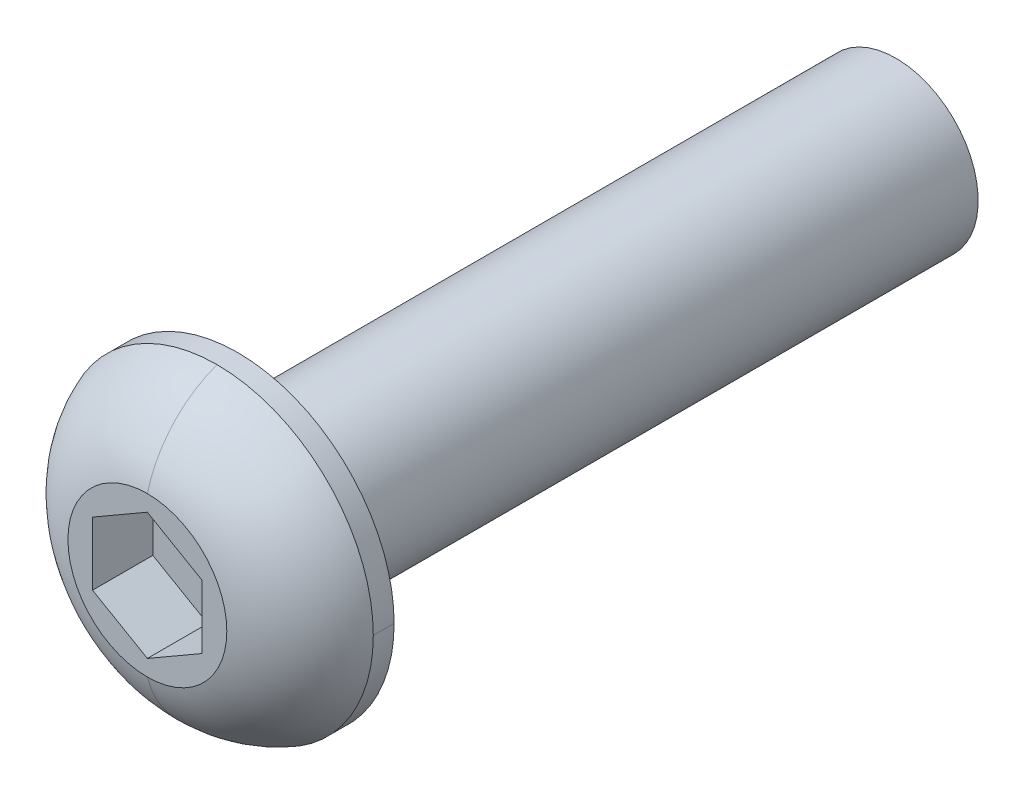
ISO-10303-21;
HEADER;
FILE_DESCRIPTION(('STEP AP214'),'2;1');
FILE_NAME('part.step','',(''),(''),'','','');
FILE_SCHEMA(('AUTOMOTIVE_DESIGN { 1 0 10303 214 1 1 1 1 }'));
ENDSEC;
DATA;
#1=APPLICATION_CONTEXT('core data for automotive mechanical design processes');
#2=APPLICATION_PROTOCOL_DEFINITION('international standard','automotive_design',2000,#1);
#3=PRODUCT_CONTEXT('',#1,'mechanical');
#4=PRODUCT('Part','Part','',(#3));
#5=PRODUCT_RELATED_PRODUCT_CATEGORY('part','',(#4));
#6=PRODUCT_DEFINITION_FORMATION('','',#4);
#7=PRODUCT_DEFINITION_CONTEXT('part definition',#1,'design');
#8=PRODUCT_DEFINITION('design','',#6,#7);
#9=PRODUCT_DEFINITION_SHAPE('','',#8);
#10=(LENGTH_UNIT() NAMED_UNIT(*) SI_UNIT(.MILLI.,.METRE.));
#11=(NAMED_UNIT(*) PLANE_ANGLE_UNIT() SI_UNIT($,.RADIAN.));
#12=(NAMED_UNIT(*) SI_UNIT($,.STERADIAN.) SOLID_ANGLE_UNIT());
#13=UNCERTAINTY_MEASURE_WITH_UNIT(LENGTH_MEASURE(1.E-05),#10,'distance_accuracy_value','');
#14=(GEOMETRIC_REPRESENTATION_CONTEXT(3) GLOBAL_UNCERTAINTY_ASSIGNED_CONTEXT((#13)) GLOBAL_UNIT_ASSIGNED_CONTEXT((#10,
#11,#12)) REPRESENTATION_CONTEXT('',''));
#15=CARTESIAN_POINT('',(0.,0.,0.));
#16=DIRECTION('',(0.,0.,1.));
#17=DIRECTION('',(1.,0.,0.));
#18=AXIS2_PLACEMENT_3D('',#15,#16,#17);
#19=CARTESIAN_POINT('',(0.,0.,0.190000000005322));
#20=DIRECTION('',(0.,0.,-1.));
#21=DIRECTION('',(-1.,0.,0.));
#22=AXIS2_PLACEMENT_3D('',#19,#20,#21);
#23=CYLINDRICAL_SURFACE('',#22,2.84999999998889);
#24=DIRECTION('',(0.,0.,-1.));
#25=VECTOR('',#24,1.);
#26=CARTESIAN_POINT('',(-2.84999999998889,0.,0.190000000005321));
#27=LINE('',#26,#25);
#28=CARTESIAN_POINT('',(-2.84999999997778,0.,0.380000000010643));
#29=VERTEX_POINT('',#28);
#30=CARTESIAN_POINT('',(-2.85,0.,0.));
#31=VERTEX_POINT('',#30);
#32=EDGE_CURVE('E198',#29,#31,#27,.T.);
#33=ORIENTED_EDGE('',*,*,#32,.F.);
#34=CARTESIAN_POINT('',(0.,0.,0.380000000010643));
#35=DIRECTION('',(0.,0.,-1.));
#36=DIRECTION('',(-1.,0.,0.));
#37=AXIS2_PLACEMENT_3D('',#34,#35,#36);
#38=CIRCLE('',#37,2.84999999997778);
#39=CARTESIAN_POINT('',(0.,2.84999999997778,0.380000000010643));
#40=VERTEX_POINT('',#39);
#41=EDGE_CURVE('E11',#29,#40,#38,.T.);
#42=ORIENTED_EDGE('',*,*,#41,.T.);
#43=CARTESIAN_POINT('',(0.,0.,0.380000000010643));
#44=DIRECTION('',(0.,0.,-1.));
#45=DIRECTION('',(-1.,0.,0.));
#46=AXIS2_PLACEMENT_3D('',#43,#44,#45);
#47=CIRCLE('',#46,2.84999999997778);
#48=CARTESIAN_POINT('',(2.84999999997778,0.,0.380000000010643));
#49=VERTEX_POINT('',#48);
#50=EDGE_CURVE('E41',#40,#49,#47,.T.);
#51=ORIENTED_EDGE('',*,*,#50,.T.);
#52=DIRECTION('',(0.,0.,1.));
#53=VECTOR('',#52,1.);
#54=CARTESIAN_POINT('',(2.84999999998889,0.,0.190000000005322));
#55=LINE('',#54,#53);
#56=CARTESIAN_POINT('',(2.85,0.,0.));
#57=VERTEX_POINT('',#56);
#58=EDGE_CURVE('E193',#57,#49,#55,.T.);
#59=ORIENTED_EDGE('',*,*,#58,.F.);
#60=CARTESIAN_POINT('',(0.,0.,0.));
#61=DIRECTION('',(0.,0.,-1.));
#62=DIRECTION('',(-1.,0.,0.));
#63=AXIS2_PLACEMENT_3D('',#60,#61,#62);
#64=CIRCLE('',#63,2.85);
#65=EDGE_CURVE('E189',#31,#57,#64,.T.);
#66=ORIENTED_EDGE('',*,*,#65,.F.);
#67=EDGE_LOOP('',(#33,#42,#51,#59,#66));
#68=FACE_BOUND('',#67,.T.);
#69=ADVANCED_FACE('F32',(#68),#23,.T.);
#70=CARTESIAN_POINT('',(0.,0.,-0.313131109201524));
#71=DIRECTION('',(0.,0.,-1.));
#72=DIRECTION('',(0.,-1.,0.));
#73=AXIS2_PLACEMENT_3D('',#70,#71,#72);
#74=DEGENERATE_TOROIDAL_SURFACE('',#73,0.945637928697733,2.02657978700265,.T.);
#75=CARTESIAN_POINT('',(0.,-0.945637928697733,-0.313131109201524));
#76=DIRECTION('',(1.,0.,0.));
#77=DIRECTION('',(0.,-1.,0.));
#78=AXIS2_PLACEMENT_3D('',#75,#76,#77);
#79=CIRCLE('',#78,2.02657978700265);
#80=CARTESIAN_POINT('',(0.,-1.44877,1.65));
#81=VERTEX_POINT('',#80);
#82=CARTESIAN_POINT('',(0.,-2.84999999997778,0.380000000010643));
#83=VERTEX_POINT('',#82);
#84=EDGE_CURVE('E167',#81,#83,#79,.T.);
#85=ORIENTED_EDGE('',*,*,#84,.F.);
#86=CARTESIAN_POINT('',(0.,0.,1.65));
#87=DIRECTION('',(0.,0.,-1.));
#88=DIRECTION('',(-1.,0.,0.));
#89=AXIS2_PLACEMENT_3D('',#86,#87,#88);
#90=CIRCLE('',#89,1.44877);
#91=CARTESIAN_POINT('',(-1.44877,0.,1.65));
#92=VERTEX_POINT('',#91);
#93=EDGE_CURVE('E182',#81,#92,#90,.T.);
#94=ORIENTED_EDGE('',*,*,#93,.T.);
#95=CARTESIAN_POINT('',(0.,0.,1.65));
#96=DIRECTION('',(0.,0.,-1.));
#97=DIRECTION('',(-1.,0.,0.));
#98=AXIS2_PLACEMENT_3D('',#95,#96,#97);
#99=CIRCLE('',#98,1.44877);
#100=CARTESIAN_POINT('',(0.,1.44877,1.65));
#101=VERTEX_POINT('',#100);
#102=EDGE_CURVE('E149',#92,#101,#99,.T.);
#103=ORIENTED_EDGE('',*,*,#102,.T.);
#104=CARTESIAN_POINT('',(0.,0.945637928697733,-0.313131109201524));
#105=DIRECTION('',(1.,0.,0.));
#106=DIRECTION('',(0.,1.,0.));
#107=AXIS2_PLACEMENT_3D('',#104,#105,#106);
#108=CIRCLE('',#107,2.02657978700265);
#109=EDGE_CURVE('E197',#40,#101,#108,.T.);
#110=ORIENTED_EDGE('',*,*,#109,.F.);
#111=ORIENTED_EDGE('',*,*,#41,.F.);
#112=CARTESIAN_POINT('',(0.,0.,0.380000000010643));
#113=DIRECTION('',(0.,0.,-1.));
#114=DIRECTION('',(-1.,0.,0.));
#115=AXIS2_PLACEMENT_3D('',#112,#113,#114);
#116=CIRCLE('',#115,2.84999999997778);
#117=EDGE_CURVE('E194',#83,#29,#116,.T.);
#118=ORIENTED_EDGE('',*,*,#117,.F.);
#119=EDGE_LOOP('',(#85,#94,#103,#110,#111,#118));
#120=FACE_BOUND('',#119,.T.);
#121=ADVANCED_FACE('F275',(#120),#74,.T.);
#122=CARTESIAN_POINT('',(0.,0.,-3.89665));
#123=DIRECTION('',(0.,0.,-1.));
#124=DIRECTION('',(-1.,0.,0.));
#125=AXIS2_PLACEMENT_3D('',#122,#123,#124);
#126=CYLINDRICAL_SURFACE('',#125,1.5);
#127=DIRECTION('',(0.,0.,1.));
#128=VECTOR('',#127,1.);
#129=CARTESIAN_POINT('',(1.5,0.,-3.89665));
#130=LINE('',#129,#128);
#131=CARTESIAN_POINT('',(1.5,0.,-7.));
#132=VERTEX_POINT('',#131);
#133=CARTESIAN_POINT('',(1.5,0.,-0.1));
#134=VERTEX_POINT('',#133);
#135=EDGE_CURVE('E48',#132,#134,#130,.T.);
#136=ORIENTED_EDGE('',*,*,#135,.F.);
#137=ORIENTED_EDGE('',*,*,#135,.T.);
#138=CARTESIAN_POINT('',(0.,0.,-0.1));
#139=DIRECTION('',(0.,0.,-1.));
#140=DIRECTION('',(-1.,0.,0.));
#141=AXIS2_PLACEMENT_3D('',#138,#139,#140);
#142=CIRCLE('',#141,1.5);
#143=CARTESIAN_POINT('',(0.,-1.5,-0.1));
#144=VERTEX_POINT('',#143);
#145=EDGE_CURVE('E152',#134,#144,#142,.T.);
#146=ORIENTED_EDGE('',*,*,#145,.T.);
#147=CARTESIAN_POINT('',(0.,0.,-0.1));
#148=DIRECTION('',(0.,0.,-1.));
#149=DIRECTION('',(-1.,0.,0.));
#150=AXIS2_PLACEMENT_3D('',#147,#148,#149);
#151=CIRCLE('',#150,1.5);
#152=CARTESIAN_POINT('',(-1.5,0.,-0.1));
#153=VERTEX_POINT('',#152);
#154=EDGE_CURVE('E146',#144,#153,#151,.T.);
#155=ORIENTED_EDGE('',*,*,#154,.T.);
#156=DIRECTION('',(0.,0.,-1.));
#157=VECTOR('',#156,1.);
#158=CARTESIAN_POINT('',(-1.5,0.,-3.89665));
#159=LINE('',#158,#157);
#160=CARTESIAN_POINT('',(-1.5,0.,-7.));
#161=VERTEX_POINT('',#160);
#162=EDGE_CURVE('E53',#153,#161,#159,.T.);
#163=ORIENTED_EDGE('',*,*,#162,.T.);
#164=ORIENTED_EDGE('',*,*,#162,.F.);
#165=CARTESIAN_POINT('',(0.,0.,-0.1));
#166=DIRECTION('',(0.,0.,-1.));
#167=DIRECTION('',(-1.,0.,0.));
#168=AXIS2_PLACEMENT_3D('',#165,#166,#167);
#169=CIRCLE('',#168,1.5);
#170=CARTESIAN_POINT('',(0.,1.5,-0.1));
#171=VERTEX_POINT('',#170);
#172=EDGE_CURVE('E139',#153,#171,#169,.T.);
#173=ORIENTED_EDGE('',*,*,#172,.T.);
#174=CARTESIAN_POINT('',(0.,0.,-0.1));
#175=DIRECTION('',(0.,0.,-1.));
#176=DIRECTION('',(-1.,0.,0.));
#177=AXIS2_PLACEMENT_3D('',#174,#175,#176);
#178=CIRCLE('',#177,1.5);
#179=EDGE_CURVE('E36',#171,#134,#178,.T.);
#180=ORIENTED_EDGE('',*,*,#179,.T.);
#181=EDGE_LOOP('',(#136,#137,#146,#155,#163,#164,#173,#180));
#182=FACE_BOUND('',#181,.T.);
#183=CARTESIAN_POINT('',(0.,0.,-12.));
#184=DIRECTION('',(0.,0.,-1.));
#185=DIRECTION('',(-1.,0.,0.));
#186=AXIS2_PLACEMENT_3D('',#183,#184,#185);
#187=CIRCLE('',#186,1.5);
#188=CARTESIAN_POINT('',(-1.5,0.,-12.));
#189=VERTEX_POINT('',#188);
#190=EDGE_CURVE('E228',#189,#189,#187,.T.);
#191=ORIENTED_EDGE('',*,*,#190,.F.);
#192=EDGE_LOOP('',(#191));
#193=FACE_BOUND('',#192,.T.);
#194=ADVANCED_FACE('F137',(#182,#193),#126,.T.);
#195=CARTESIAN_POINT('',(0.,0.,-0.1));
#196=DIRECTION('',(0.,0.,-1.));
#197=DIRECTION('',(0.,-1.,0.));
#198=AXIS2_PLACEMENT_3D('',#195,#196,#197);
#199=TOROIDAL_SURFACE('',#198,1.6,0.1);
#200=CARTESIAN_POINT('',(0.,1.6,-0.1));
#201=DIRECTION('',(1.,0.,0.));
#202=DIRECTION('',(0.,1.,0.));
#203=AXIS2_PLACEMENT_3D('',#200,#201,#202);
#204=CIRCLE('',#203,0.1);
#205=CARTESIAN_POINT('',(0.,1.6,0.));
#206=VERTEX_POINT('',#205);
#207=EDGE_CURVE('E148',#206,#171,#204,.T.);
#208=ORIENTED_EDGE('',*,*,#207,.F.);
#209=CARTESIAN_POINT('',(0.,0.,0.));
#210=DIRECTION('',(0.,0.,-1.));
#211=DIRECTION('',(-1.,0.,0.));
#212=AXIS2_PLACEMENT_3D('',#209,#210,#211);
#213=CIRCLE('',#212,1.6);
#214=CARTESIAN_POINT('',(0.,-1.6,0.));
#215=VERTEX_POINT('',#214);
#216=EDGE_CURVE('E233',#206,#215,#213,.T.);
#217=ORIENTED_EDGE('',*,*,#216,.T.);
#218=CARTESIAN_POINT('',(0.,-1.6,-0.1));
#219=DIRECTION('',(1.,0.,0.));
#220=DIRECTION('',(0.,-1.,0.));
#221=AXIS2_PLACEMENT_3D('',#218,#219,#220);
#222=CIRCLE('',#221,0.1);
#223=EDGE_CURVE('E222',#144,#215,#222,.T.);
#224=ORIENTED_EDGE('',*,*,#223,.F.);
#225=ORIENTED_EDGE('',*,*,#145,.F.);
#226=ORIENTED_EDGE('',*,*,#179,.F.);
#227=EDGE_LOOP('',(#208,#217,#224,#225,#226));
#228=FACE_BOUND('',#227,.T.);
#229=ADVANCED_FACE('F274',(#228),#199,.F.);
#230=CARTESIAN_POINT('',(1.,0.2886751346,1.65));
#231=DIRECTION('',(1.,0.,0.));
#232=DIRECTION('',(0.,1.,0.));
#233=AXIS2_PLACEMENT_3D('',#230,#231,#232);
#234=PLANE('',#233);
#235=DIRECTION('',(0.,1.,0.));
#236=VECTOR('',#235,1.);
#237=CARTESIAN_POINT('',(1.,0.,0.55));
#238=LINE('',#237,#236);
#239=CARTESIAN_POINT('',(1.,-0.5773502692,0.55));
#240=VERTEX_POINT('',#239);
#241=CARTESIAN_POINT('',(1.,0.5773502692,0.55));
#242=VERTEX_POINT('',#241);
#243=EDGE_CURVE('E170',#240,#242,#238,.T.);
#244=ORIENTED_EDGE('',*,*,#243,.F.);
#245=DIRECTION('',(0.,0.,-1.));
#246=VECTOR('',#245,1.);
#247=CARTESIAN_POINT('',(1.,-0.5773502692,1.65));
#248=LINE('',#247,#246);
#249=CARTESIAN_POINT('',(1.,-0.5773502692,1.65));
#250=VERTEX_POINT('',#249);
#251=EDGE_CURVE('E179',#250,#240,#248,.T.);
#252=ORIENTED_EDGE('',*,*,#251,.F.);
#253=DIRECTION('',(0.,-1.,0.));
#254=VECTOR('',#253,1.);
#255=CARTESIAN_POINT('',(1.,0.1443375673,1.65));
#256=LINE('',#255,#254);
#257=CARTESIAN_POINT('',(1.,0.5773502692,1.65));
#258=VERTEX_POINT('',#257);
#259=EDGE_CURVE('E154',#258,#250,#256,.T.);
#260=ORIENTED_EDGE('',*,*,#259,.F.);
#261=DIRECTION('',(0.,0.,-1.));
#262=VECTOR('',#261,1.);
#263=CARTESIAN_POINT('',(1.,0.5773502692,1.65));
#264=LINE('',#263,#262);
#265=EDGE_CURVE('E230',#258,#242,#264,.T.);
#266=ORIENTED_EDGE('',*,*,#265,.T.);
#267=EDGE_LOOP('',(#244,#252,#260,#266));
#268=FACE_BOUND('',#267,.T.);
#269=ADVANCED_FACE('F34',(#268),#234,.F.);
#270=CARTESIAN_POINT('',(0.5,0.8660254038,1.65));
#271=DIRECTION('',(0.500000000006738,0.866025403780548,0.));
#272=DIRECTION('',(0.,0.,-1.));
#273=AXIS2_PLACEMENT_3D('',#270,#271,#272);
#274=PLANE('',#273);
#275=DIRECTION('',(-0.866025403780548,0.500000000006738,0.));
#276=VECTOR('',#275,1.);
#277=CARTESIAN_POINT('',(0.,1.1547005384,0.55));
#278=LINE('',#277,#276);
#279=CARTESIAN_POINT('',(0.,1.1547005384,0.55));
#280=VERTEX_POINT('',#279);
#281=EDGE_CURVE('E168',#242,#280,#278,.T.);
#282=ORIENTED_EDGE('',*,*,#281,.F.);
#283=ORIENTED_EDGE('',*,*,#265,.F.);
#284=DIRECTION('',(0.866025403780548,-0.500000000006738,0.));
#285=VECTOR('',#284,1.);
#286=CARTESIAN_POINT('',(0.0127306250111162,1.14735050862275,1.65));
#287=LINE('',#286,#285);
#288=CARTESIAN_POINT('',(0.,1.1547005384,1.65));
#289=VERTEX_POINT('',#288);
#290=EDGE_CURVE('E163',#289,#258,#287,.T.);
#291=ORIENTED_EDGE('',*,*,#290,.F.);
#292=DIRECTION('',(0.,0.,-1.));
#293=VECTOR('',#292,1.);
#294=CARTESIAN_POINT('',(0.,1.1547005384,1.65));
#295=LINE('',#294,#293);
#296=EDGE_CURVE('E211',#289,#280,#295,.T.);
#297=ORIENTED_EDGE('',*,*,#296,.T.);
#298=EDGE_LOOP('',(#282,#283,#291,#297));
#299=FACE_BOUND('',#298,.T.);
#300=ADVANCED_FACE('F325',(#299),#274,.F.);
#301=CARTESIAN_POINT('',(-0.5,0.8660254038,1.65));
#302=DIRECTION('',(-0.500000000006738,0.866025403780548,0.));
#303=DIRECTION('',(0.,0.,1.));
#304=AXIS2_PLACEMENT_3D('',#301,#302,#303);
#305=PLANE('',#304);
#306=DIRECTION('',(-0.866025403780548,-0.500000000006738,0.));
#307=VECTOR('',#306,1.);
#308=CARTESIAN_POINT('',(-1.,0.5773502692,0.55));
#309=LINE('',#308,#307);
#310=CARTESIAN_POINT('',(-1.,0.5773502692,0.55));
#311=VERTEX_POINT('',#310);
#312=EDGE_CURVE('E171',#280,#311,#309,.T.);
#313=ORIENTED_EDGE('',*,*,#312,.F.);
#314=ORIENTED_EDGE('',*,*,#296,.F.);
#315=DIRECTION('',(0.866025403780548,0.500000000006738,0.));
#316=VECTOR('',#315,1.);
#317=CARTESIAN_POINT('',(-0.98726937500236,0.584700298969471,1.65));
#318=LINE('',#317,#316);
#319=CARTESIAN_POINT('',(-1.,0.5773502692,1.65));
#320=VERTEX_POINT('',#319);
#321=EDGE_CURVE('E166',#320,#289,#318,.T.);
#322=ORIENTED_EDGE('',*,*,#321,.F.);
#323=DIRECTION('',(0.,0.,-1.));
#324=VECTOR('',#323,1.);
#325=CARTESIAN_POINT('',(-1.,0.5773502692,1.65));
#326=LINE('',#325,#324);
#327=EDGE_CURVE('E213',#320,#311,#326,.T.);
#328=ORIENTED_EDGE('',*,*,#327,.T.);
#329=EDGE_LOOP('',(#313,#314,#322,#328));
#330=FACE_BOUND('',#329,.T.);
#331=ADVANCED_FACE('F322',(#330),#305,.F.);
#332=CARTESIAN_POINT('',(-1.,0.,1.65));
#333=DIRECTION('',(-1.,0.,0.));
#334=DIRECTION('',(0.,0.,1.));
#335=AXIS2_PLACEMENT_3D('',#332,#333,#334);
#336=PLANE('',#335);
#337=DIRECTION('',(0.,-1.,0.));
#338=VECTOR('',#337,1.);
#339=CARTESIAN_POINT('',(-1.,-0.5773502692,0.55));
#340=LINE('',#339,#338);
#341=CARTESIAN_POINT('',(-1.,-0.5773502692,0.55));
#342=VERTEX_POINT('',#341);
#343=EDGE_CURVE('E172',#311,#342,#340,.T.);
#344=ORIENTED_EDGE('',*,*,#343,.F.);
#345=ORIENTED_EDGE('',*,*,#327,.F.);
#346=DIRECTION('',(0.,1.,0.));
#347=VECTOR('',#346,1.);
#348=CARTESIAN_POINT('',(-1.,0.,1.65));
#349=LINE('',#348,#347);
#350=CARTESIAN_POINT('',(-1.,-0.5773502692,1.65));
#351=VERTEX_POINT('',#350);
#352=EDGE_CURVE('E183',#351,#320,#349,.T.);
#353=ORIENTED_EDGE('',*,*,#352,.F.);
#354=DIRECTION('',(0.,0.,-1.));
#355=VECTOR('',#354,1.);
#356=CARTESIAN_POINT('',(-1.,-0.5773502692,1.65));
#357=LINE('',#356,#355);
#358=EDGE_CURVE('E178',#351,#342,#357,.T.);
#359=ORIENTED_EDGE('',*,*,#358,.T.);
#360=EDGE_LOOP('',(#344,#345,#353,#359));
#361=FACE_BOUND('',#360,.T.);
#362=ADVANCED_FACE('F260',(#361),#336,.F.);
#363=CARTESIAN_POINT('',(-0.5,-0.8660254038,1.65));
#364=DIRECTION('',(-0.500000000006738,-0.866025403780548,0.));
#365=DIRECTION('',(-0.866025403780548,0.500000000006738,0.));
#366=AXIS2_PLACEMENT_3D('',#363,#364,#365);
#367=PLANE('',#366);
#368=DIRECTION('',(0.866025403780548,-0.500000000006738,0.));
#369=VECTOR('',#368,1.);
#370=CARTESIAN_POINT('',(0.,-1.1547005384,0.55));
#371=LINE('',#370,#369);
#372=CARTESIAN_POINT('',(0.,-1.1547005384,0.55));
#373=VERTEX_POINT('',#372);
#374=EDGE_CURVE('E174',#342,#373,#371,.T.);
#375=ORIENTED_EDGE('',*,*,#374,.F.);
#376=ORIENTED_EDGE('',*,*,#358,.F.);
#377=DIRECTION('',(-0.866025403780548,0.500000000006738,0.));
#378=VECTOR('',#377,1.);
#379=CARTESIAN_POINT('',(-0.98726937500236,-0.584700298969471,1.65));
#380=LINE('',#379,#378);
#381=CARTESIAN_POINT('',(0.,-1.1547005384,1.65));
#382=VERTEX_POINT('',#381);
#383=EDGE_CURVE('E161',#382,#351,#380,.T.);
#384=ORIENTED_EDGE('',*,*,#383,.F.);
#385=DIRECTION('',(0.,0.,-1.));
#386=VECTOR('',#385,1.);
#387=CARTESIAN_POINT('',(0.,-1.1547005384,1.65));
#388=LINE('',#387,#386);
#389=EDGE_CURVE('E175',#382,#373,#388,.T.);
#390=ORIENTED_EDGE('',*,*,#389,.T.);
#391=EDGE_LOOP('',(#375,#376,#384,#390));
#392=FACE_BOUND('',#391,.T.);
#393=ADVANCED_FACE('F247',(#392),#367,.F.);
#394=CARTESIAN_POINT('',(0.5,-0.8660254038,1.65));
#395=DIRECTION('',(0.500000000006738,-0.866025403780548,0.));
#396=DIRECTION('',(0.,0.,-1.));
#397=AXIS2_PLACEMENT_3D('',#394,#395,#396);
#398=PLANE('',#397);
#399=DIRECTION('',(0.866025403780548,0.500000000006738,0.));
#400=VECTOR('',#399,1.);
#401=CARTESIAN_POINT('',(1.,-0.5773502692,0.55));
#402=LINE('',#401,#400);
#403=EDGE_CURVE('E216',#373,#240,#402,.T.);
#404=ORIENTED_EDGE('',*,*,#403,.F.);
#405=ORIENTED_EDGE('',*,*,#389,.F.);
#406=DIRECTION('',(-0.866025403780548,-0.500000000006738,0.));
#407=VECTOR('',#406,1.);
#408=CARTESIAN_POINT('',(0.0127306250111161,-1.14735050862275,1.65));
#409=LINE('',#408,#407);
#410=EDGE_CURVE('E157',#250,#382,#409,.T.);
#411=ORIENTED_EDGE('',*,*,#410,.F.);
#412=ORIENTED_EDGE('',*,*,#251,.T.);
#413=EDGE_LOOP('',(#404,#405,#411,#412));
#414=FACE_BOUND('',#413,.T.);
#415=ADVANCED_FACE('F251',(#414),#398,.F.);
#416=CARTESIAN_POINT('',(0.,0.,0.55));
#417=DIRECTION('',(0.,0.,-1.));
#418=DIRECTION('',(0.,-1.,0.));
#419=AXIS2_PLACEMENT_3D('',#416,#417,#418);
#420=PLANE('',#419);
#421=ORIENTED_EDGE('',*,*,#243,.T.);
#422=ORIENTED_EDGE('',*,*,#281,.T.);
#423=ORIENTED_EDGE('',*,*,#312,.T.);
#424=ORIENTED_EDGE('',*,*,#343,.T.);
#425=ORIENTED_EDGE('',*,*,#374,.T.);
#426=ORIENTED_EDGE('',*,*,#403,.T.);
#427=EDGE_LOOP('',(#421,#422,#423,#424,#425,#426));
#428=FACE_BOUND('',#427,.T.);
#429=ADVANCED_FACE('F255',(#428),#420,.F.);
#430=CARTESIAN_POINT('',(-2.225,0.,0.));
#431=DIRECTION('',(0.,0.,-1.));
#432=DIRECTION('',(0.,-1.,0.));
#433=AXIS2_PLACEMENT_3D('',#430,#431,#432);
#434=PLANE('',#433);
#435=ORIENTED_EDGE('',*,*,#65,.T.);
#436=CARTESIAN_POINT('',(0.,0.,0.));
#437=DIRECTION('',(0.,0.,-1.));
#438=DIRECTION('',(-1.,0.,0.));
#439=AXIS2_PLACEMENT_3D('',#436,#437,#438);
#440=CIRCLE('',#439,2.85);
#441=EDGE_CURVE('E186',#57,#31,#440,.T.);
#442=ORIENTED_EDGE('',*,*,#441,.T.);
#443=EDGE_LOOP('',(#435,#442));
#444=FACE_BOUND('',#443,.T.);
#445=CARTESIAN_POINT('',(0.,0.,0.));
#446=DIRECTION('',(0.,0.,-1.));
#447=DIRECTION('',(-1.,0.,0.));
#448=AXIS2_PLACEMENT_3D('',#445,#446,#447);
#449=CIRCLE('',#448,1.6);
#450=CARTESIAN_POINT('',(-1.6,0.,0.));
#451=VERTEX_POINT('',#450);
#452=EDGE_CURVE('E141',#451,#206,#449,.T.);
#453=ORIENTED_EDGE('',*,*,#452,.F.);
#454=CARTESIAN_POINT('',(0.,0.,0.));
#455=DIRECTION('',(0.,0.,-1.));
#456=DIRECTION('',(-1.,0.,0.));
#457=AXIS2_PLACEMENT_3D('',#454,#455,#456);
#458=CIRCLE('',#457,1.6);
#459=EDGE_CURVE('E219',#215,#451,#458,.T.);
#460=ORIENTED_EDGE('',*,*,#459,.F.);
#461=ORIENTED_EDGE('',*,*,#216,.F.);
#462=EDGE_LOOP('',(#453,#460,#461));
#463=FACE_BOUND('',#462,.T.);
#464=ADVANCED_FACE('F299',(#444,#463),#434,.T.);
#465=CARTESIAN_POINT('',(0.,0.,-0.1));
#466=DIRECTION('',(0.,0.,-1.));
#467=DIRECTION('',(0.,-1.,0.));
#468=AXIS2_PLACEMENT_3D('',#465,#466,#467);
#469=TOROIDAL_SURFACE('',#468,1.6,0.1);
#470=ORIENTED_EDGE('',*,*,#207,.T.);
#471=ORIENTED_EDGE('',*,*,#172,.F.);
#472=ORIENTED_EDGE('',*,*,#154,.F.);
#473=ORIENTED_EDGE('',*,*,#223,.T.);
#474=ORIENTED_EDGE('',*,*,#459,.T.);
#475=ORIENTED_EDGE('',*,*,#452,.T.);
#476=EDGE_LOOP('',(#470,#471,#472,#473,#474,#475));
#477=FACE_BOUND('',#476,.T.);
#478=ADVANCED_FACE('F145',(#477),#469,.F.);
#479=CARTESIAN_POINT('',(-1.299385,0.,1.65));
#480=DIRECTION('',(0.,0.,1.));
#481=DIRECTION('',(1.,0.,0.));
#482=AXIS2_PLACEMENT_3D('',#479,#480,#481);
#483=PLANE('',#482);
#484=ORIENTED_EDGE('',*,*,#102,.F.);
#485=ORIENTED_EDGE('',*,*,#93,.F.);
#486=CARTESIAN_POINT('',(0.,0.,1.65));
#487=DIRECTION('',(0.,0.,-1.));
#488=DIRECTION('',(-1.,0.,0.));
#489=AXIS2_PLACEMENT_3D('',#486,#487,#488);
#490=CIRCLE('',#489,1.44877);
#491=EDGE_CURVE('E195',#101,#81,#490,.T.);
#492=ORIENTED_EDGE('',*,*,#491,.F.);
#493=EDGE_LOOP('',(#484,#485,#492));
#494=FACE_BOUND('',#493,.T.);
#495=ORIENTED_EDGE('',*,*,#259,.T.);
#496=ORIENTED_EDGE('',*,*,#410,.T.);
#497=ORIENTED_EDGE('',*,*,#383,.T.);
#498=ORIENTED_EDGE('',*,*,#352,.T.);
#499=ORIENTED_EDGE('',*,*,#321,.T.);
#500=ORIENTED_EDGE('',*,*,#290,.T.);
#501=EDGE_LOOP('',(#495,#496,#497,#498,#499,#500));
#502=FACE_BOUND('',#501,.T.);
#503=ADVANCED_FACE('F242',(#494,#502),#483,.T.);
#504=CARTESIAN_POINT('',(0.,0.,-0.313131109201524));
#505=DIRECTION('',(0.,0.,-1.));
#506=DIRECTION('',(0.,-1.,0.));
#507=AXIS2_PLACEMENT_3D('',#504,#505,#506);
#508=DEGENERATE_TOROIDAL_SURFACE('',#507,0.945637928697733,2.02657978700265,.T.);
#509=ORIENTED_EDGE('',*,*,#84,.T.);
#510=CARTESIAN_POINT('',(0.,0.,0.380000000010643));
#511=DIRECTION('',(0.,0.,-1.));
#512=DIRECTION('',(-1.,0.,0.));
#513=AXIS2_PLACEMENT_3D('',#510,#511,#512);
#514=CIRCLE('',#513,2.84999999997778);
#515=EDGE_CURVE('E191',#49,#83,#514,.T.);
#516=ORIENTED_EDGE('',*,*,#515,.F.);
#517=ORIENTED_EDGE('',*,*,#50,.F.);
#518=ORIENTED_EDGE('',*,*,#109,.T.);
#519=ORIENTED_EDGE('',*,*,#491,.T.);
#520=EDGE_LOOP('',(#509,#516,#517,#518,#519));
#521=FACE_BOUND('',#520,.T.);
#522=ADVANCED_FACE('F301',(#521),#508,.T.);
#523=CARTESIAN_POINT('',(0.,0.,0.190000000005322));
#524=DIRECTION('',(0.,0.,-1.));
#525=DIRECTION('',(-1.,0.,0.));
#526=AXIS2_PLACEMENT_3D('',#523,#524,#525);
#527=CYLINDRICAL_SURFACE('',#526,2.84999999998889);
#528=ORIENTED_EDGE('',*,*,#32,.T.);
#529=ORIENTED_EDGE('',*,*,#441,.F.);
#530=ORIENTED_EDGE('',*,*,#58,.T.);
#531=ORIENTED_EDGE('',*,*,#515,.T.);
#532=ORIENTED_EDGE('',*,*,#117,.T.);
#533=EDGE_LOOP('',(#528,#529,#530,#531,#532));
#534=FACE_BOUND('',#533,.T.);
#535=ADVANCED_FACE('F293',(#534),#527,.T.);
#536=CARTESIAN_POINT('',(0.,0.,-12.));
#537=DIRECTION('',(0.,0.,-1.));
#538=DIRECTION('',(-1.,0.,0.));
#539=AXIS2_PLACEMENT_3D('',#536,#537,#538);
#540=PLANE('',#539);
#541=ORIENTED_EDGE('',*,*,#190,.T.);
#542=EDGE_LOOP('',(#541));
#543=FACE_BOUND('',#542,.T.);
#544=ADVANCED_FACE('F272',(#543),#540,.T.);
#545=CLOSED_SHELL('',(#69,#121,#194,#229,#269,#300,#331,#362,#393,#415,#429,#464,#478,#503,#522,
#535,#544));
#546=MANIFOLD_SOLID_BREP('B2',#545);
#547=ADVANCED_BREP_SHAPE_REPRESENTATION('',(#18,#546),#14);
#548=SHAPE_DEFINITION_REPRESENTATION(#9,#547);
ENDSEC;
END-ISO-10303-21;
